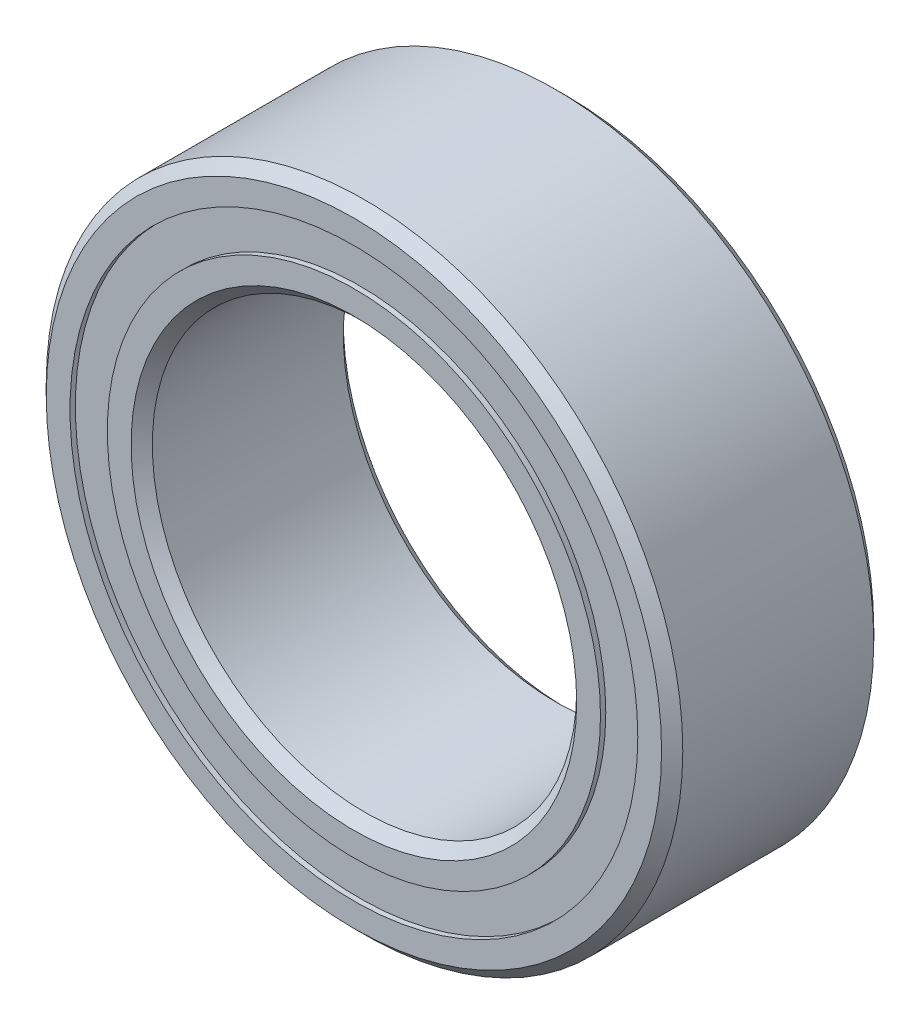
ISO-10303-21;
HEADER;
FILE_DESCRIPTION(('STEP AP214'),'2;1');
FILE_NAME('part.step','',(''),(''),'','','');
FILE_SCHEMA(('AUTOMOTIVE_DESIGN { 1 0 10303 214 1 1 1 1 }'));
ENDSEC;
DATA;
#1=APPLICATION_CONTEXT('core data for automotive mechanical design processes');
#2=APPLICATION_PROTOCOL_DEFINITION('international standard','automotive_design',2000,#1);
#3=PRODUCT_CONTEXT('',#1,'mechanical');
#4=PRODUCT('Part','Part','',(#3));
#5=PRODUCT_RELATED_PRODUCT_CATEGORY('part','',(#4));
#6=PRODUCT_DEFINITION_FORMATION('','',#4);
#7=PRODUCT_DEFINITION_CONTEXT('part definition',#1,'design');
#8=PRODUCT_DEFINITION('design','',#6,#7);
#9=PRODUCT_DEFINITION_SHAPE('','',#8);
#10=(LENGTH_UNIT() NAMED_UNIT(*) SI_UNIT(.MILLI.,.METRE.));
#11=(NAMED_UNIT(*) PLANE_ANGLE_UNIT() SI_UNIT($,.RADIAN.));
#12=(NAMED_UNIT(*) SI_UNIT($,.STERADIAN.) SOLID_ANGLE_UNIT());
#13=UNCERTAINTY_MEASURE_WITH_UNIT(LENGTH_MEASURE(1.E-05),#10,'distance_accuracy_value','');
#14=(GEOMETRIC_REPRESENTATION_CONTEXT(3) GLOBAL_UNCERTAINTY_ASSIGNED_CONTEXT((#13)) GLOBAL_UNIT_ASSIGNED_CONTEXT((#10,
#11,#12)) REPRESENTATION_CONTEXT('',''));
#15=CARTESIAN_POINT('',(0.,0.,0.));
#16=DIRECTION('',(0.,0.,1.));
#17=DIRECTION('',(1.,0.,0.));
#18=AXIS2_PLACEMENT_3D('',#15,#16,#17);
#19=CARTESIAN_POINT('',(0.,4.24787087912088,-1.508125));
#20=DIRECTION('',(0.,0.,1.));
#21=DIRECTION('',(1.,0.,0.));
#22=AXIS2_PLACEMENT_3D('',#19,#20,#21);
#23=PLANE('',#22);
#24=CARTESIAN_POINT('',(0.,0.,-1.508125));
#25=DIRECTION('',(0.,0.,1.));
#26=DIRECTION('',(1.,0.,0.));
#27=AXIS2_PLACEMENT_3D('',#24,#25,#26);
#28=CIRCLE('',#27,4.24787087912088);
#29=CARTESIAN_POINT('',(4.24787087912088,0.,-1.508125));
#30=VERTEX_POINT('',#29);
#31=EDGE_CURVE('E56',#30,#30,#28,.T.);
#32=ORIENTED_EDGE('',*,*,#31,.F.);
#33=EDGE_LOOP('',(#32));
#34=FACE_BOUND('',#33,.T.);
#35=CARTESIAN_POINT('',(0.,0.,-1.508125));
#36=DIRECTION('',(0.,0.,1.));
#37=DIRECTION('',(1.,0.,0.));
#38=AXIS2_PLACEMENT_3D('',#35,#36,#37);
#39=CIRCLE('',#38,3.68962912087912);
#40=CARTESIAN_POINT('',(3.68962912087912,0.,-1.508125));
#41=VERTEX_POINT('',#40);
#42=EDGE_CURVE('E11',#41,#41,#39,.T.);
#43=ORIENTED_EDGE('',*,*,#42,.T.);
#44=EDGE_LOOP('',(#43));
#45=FACE_BOUND('',#44,.T.);
#46=ADVANCED_FACE('F42',(#34,#45),#23,.F.);
#47=CARTESIAN_POINT('',(0.,0.,1.5875));
#48=DIRECTION('',(0.,0.,1.));
#49=DIRECTION('',(1.,0.,0.));
#50=AXIS2_PLACEMENT_3D('',#47,#48,#49);
#51=CYLINDRICAL_SURFACE('',#50,3.68962912087912);
#52=ORIENTED_EDGE('',*,*,#42,.F.);
#53=EDGE_LOOP('',(#52));
#54=FACE_BOUND('',#53,.T.);
#55=CARTESIAN_POINT('',(0.,0.,-0.758760243513405));
#56=DIRECTION('',(0.,0.,1.));
#57=DIRECTION('',(1.,0.,0.));
#58=AXIS2_PLACEMENT_3D('',#55,#56,#57);
#59=CIRCLE('',#58,3.68962912087912);
#60=CARTESIAN_POINT('',(3.68962912087912,0.,-0.758760243513405));
#61=VERTEX_POINT('',#60);
#62=EDGE_CURVE('E48',#61,#61,#59,.T.);
#63=ORIENTED_EDGE('',*,*,#62,.T.);
#64=EDGE_LOOP('',(#63));
#65=FACE_BOUND('',#64,.T.);
#66=ADVANCED_FACE('F65',(#54,#65),#51,.F.);
#67=CARTESIAN_POINT('',(0.,4.24787087912088,-0.758760243513405));
#68=DIRECTION('',(0.,0.,-1.));
#69=DIRECTION('',(-1.,0.,0.));
#70=AXIS2_PLACEMENT_3D('',#67,#68,#69);
#71=PLANE('',#70);
#72=ORIENTED_EDGE('',*,*,#62,.F.);
#73=EDGE_LOOP('',(#72));
#74=FACE_BOUND('',#73,.T.);
#75=CARTESIAN_POINT('',(0.,0.,-0.758760243513405));
#76=DIRECTION('',(0.,0.,1.));
#77=DIRECTION('',(1.,0.,0.));
#78=AXIS2_PLACEMENT_3D('',#75,#76,#77);
#79=CIRCLE('',#78,4.24787087912088);
#80=CARTESIAN_POINT('',(4.24787087912088,0.,-0.758760243513405));
#81=VERTEX_POINT('',#80);
#82=EDGE_CURVE('E52',#81,#81,#79,.T.);
#83=ORIENTED_EDGE('',*,*,#82,.T.);
#84=EDGE_LOOP('',(#83));
#85=FACE_BOUND('',#84,.T.);
#86=ADVANCED_FACE('F69',(#74,#85),#71,.F.);
#87=CARTESIAN_POINT('',(0.,0.,1.5875));
#88=DIRECTION('',(0.,0.,1.));
#89=DIRECTION('',(1.,0.,0.));
#90=AXIS2_PLACEMENT_3D('',#87,#88,#89);
#91=CYLINDRICAL_SURFACE('',#90,4.24787087912088);
#92=ORIENTED_EDGE('',*,*,#82,.F.);
#93=EDGE_LOOP('',(#92));
#94=FACE_BOUND('',#93,.T.);
#95=ORIENTED_EDGE('',*,*,#31,.T.);
#96=EDGE_LOOP('',(#95));
#97=FACE_BOUND('',#96,.T.);
#98=ADVANCED_FACE('F62',(#94,#97),#91,.T.);
#99=CLOSED_SHELL('',(#46,#66,#86,#98));
#100=MANIFOLD_SOLID_BREP('B2',#99);
#101=CARTESIAN_POINT('',(0.,4.24787087912088,1.508125));
#102=DIRECTION('',(0.,0.,-1.));
#103=DIRECTION('',(-1.,0.,0.));
#104=AXIS2_PLACEMENT_3D('',#101,#102,#103);
#105=PLANE('',#104);
#106=CARTESIAN_POINT('',(0.,0.,1.508125));
#107=DIRECTION('',(0.,0.,1.));
#108=DIRECTION('',(1.,0.,0.));
#109=AXIS2_PLACEMENT_3D('',#106,#107,#108);
#110=CIRCLE('',#109,3.68962912087912);
#111=CARTESIAN_POINT('',(3.68962912087912,0.,1.508125));
#112=VERTEX_POINT('',#111);
#113=EDGE_CURVE('E41',#112,#112,#110,.T.);
#114=ORIENTED_EDGE('',*,*,#113,.F.);
#115=EDGE_LOOP('',(#114));
#116=FACE_BOUND('',#115,.T.);
#117=CARTESIAN_POINT('',(0.,0.,1.508125));
#118=DIRECTION('',(0.,0.,1.));
#119=DIRECTION('',(1.,0.,0.));
#120=AXIS2_PLACEMENT_3D('',#117,#118,#119);
#121=CIRCLE('',#120,4.24787087912088);
#122=CARTESIAN_POINT('',(4.24787087912088,0.,1.508125));
#123=VERTEX_POINT('',#122);
#124=EDGE_CURVE('E124',#123,#123,#121,.T.);
#125=ORIENTED_EDGE('',*,*,#124,.T.);
#126=EDGE_LOOP('',(#125));
#127=FACE_BOUND('',#126,.T.);
#128=ADVANCED_FACE('F110',(#116,#127),#105,.F.);
#129=CARTESIAN_POINT('',(0.,0.,1.5875));
#130=DIRECTION('',(0.,0.,1.));
#131=DIRECTION('',(1.,0.,0.));
#132=AXIS2_PLACEMENT_3D('',#129,#130,#131);
#133=CYLINDRICAL_SURFACE('',#132,3.68962912087912);
#134=CARTESIAN_POINT('',(0.,0.,0.758760243513404));
#135=DIRECTION('',(0.,0.,1.));
#136=DIRECTION('',(1.,0.,0.));
#137=AXIS2_PLACEMENT_3D('',#134,#135,#136);
#138=CIRCLE('',#137,3.68962912087912);
#139=CARTESIAN_POINT('',(3.68962912087912,0.,0.758760243513404));
#140=VERTEX_POINT('',#139);
#141=EDGE_CURVE('E116',#140,#140,#138,.T.);
#142=ORIENTED_EDGE('',*,*,#141,.F.);
#143=EDGE_LOOP('',(#142));
#144=FACE_BOUND('',#143,.T.);
#145=ORIENTED_EDGE('',*,*,#113,.T.);
#146=EDGE_LOOP('',(#145));
#147=FACE_BOUND('',#146,.T.);
#148=ADVANCED_FACE('F139',(#144,#147),#133,.F.);
#149=CARTESIAN_POINT('',(0.,4.24787087912088,0.758760243513404));
#150=DIRECTION('',(0.,0.,1.));
#151=DIRECTION('',(1.,0.,0.));
#152=AXIS2_PLACEMENT_3D('',#149,#150,#151);
#153=PLANE('',#152);
#154=CARTESIAN_POINT('',(0.,0.,0.758760243513404));
#155=DIRECTION('',(0.,0.,1.));
#156=DIRECTION('',(1.,0.,0.));
#157=AXIS2_PLACEMENT_3D('',#154,#155,#156);
#158=CIRCLE('',#157,4.24787087912088);
#159=CARTESIAN_POINT('',(4.24787087912088,0.,0.758760243513404));
#160=VERTEX_POINT('',#159);
#161=EDGE_CURVE('E120',#160,#160,#158,.T.);
#162=ORIENTED_EDGE('',*,*,#161,.F.);
#163=EDGE_LOOP('',(#162));
#164=FACE_BOUND('',#163,.T.);
#165=ORIENTED_EDGE('',*,*,#141,.T.);
#166=EDGE_LOOP('',(#165));
#167=FACE_BOUND('',#166,.T.);
#168=ADVANCED_FACE('F134',(#164,#167),#153,.F.);
#169=CARTESIAN_POINT('',(0.,0.,1.5875));
#170=DIRECTION('',(0.,0.,1.));
#171=DIRECTION('',(1.,0.,0.));
#172=AXIS2_PLACEMENT_3D('',#169,#170,#171);
#173=CYLINDRICAL_SURFACE('',#172,4.24787087912088);
#174=ORIENTED_EDGE('',*,*,#124,.F.);
#175=EDGE_LOOP('',(#174));
#176=FACE_BOUND('',#175,.T.);
#177=ORIENTED_EDGE('',*,*,#161,.T.);
#178=EDGE_LOOP('',(#177));
#179=FACE_BOUND('',#178,.T.);
#180=ADVANCED_FACE('F131',(#176,#179),#173,.T.);
#181=CLOSED_SHELL('',(#128,#148,#168,#180));
#182=MANIFOLD_SOLID_BREP('B6',#181);
#183=CARTESIAN_POINT('',(-1.98437499999996,3.43703832126952,0.));
#184=DIRECTION('',(0.,0.,1.));
#185=DIRECTION('',(-0.499999999999989,0.866025403784445,0.));
#186=AXIS2_PLACEMENT_3D('',#183,#184,#185);
#187=SPHERICAL_SURFACE('',#186,0.758760243513404);
#188=CARTESIAN_POINT('',(-1.98437499999996,3.43703832126952,0.758760243513404));
#189=VERTEX_POINT('',#188);
#190=VERTEX_LOOP('',#189);
#191=FACE_BOUND('',#190,.T.);
#192=ADVANCED_FACE('F177',(#191),#187,.T.);
#193=CLOSED_SHELL('',(#192));
#194=MANIFOLD_SOLID_BREP('B36',#193);
#195=CARTESIAN_POINT('',(-3.43703832126947,1.98437500000004,0.));
#196=DIRECTION('',(0.,0.,1.));
#197=DIRECTION('',(-0.866025403784433,0.50000000000001,0.));
#198=AXIS2_PLACEMENT_3D('',#195,#196,#197);
#199=SPHERICAL_SURFACE('',#198,0.758760243513404);
#200=CARTESIAN_POINT('',(-3.43703832126947,1.98437500000004,0.758760243513404));
#201=VERTEX_POINT('',#200);
#202=VERTEX_LOOP('',#201);
#203=FACE_BOUND('',#202,.T.);
#204=ADVANCED_FACE('F197',(#203),#199,.T.);
#205=CLOSED_SHELL('',(#204));
#206=MANIFOLD_SOLID_BREP('B106',#205);
#207=CARTESIAN_POINT('',(-3.96875,0.,0.));
#208=DIRECTION('',(0.,0.,1.));
#209=DIRECTION('',(-1.,0.,0.));
#210=AXIS2_PLACEMENT_3D('',#207,#208,#209);
#211=SPHERICAL_SURFACE('',#210,0.758760243513404);
#212=CARTESIAN_POINT('',(-3.96875,0.,0.758760243513404));
#213=VERTEX_POINT('',#212);
#214=VERTEX_LOOP('',#213);
#215=FACE_BOUND('',#214,.T.);
#216=ADVANCED_FACE('F217',(#215),#211,.T.);
#217=CLOSED_SHELL('',(#216));
#218=MANIFOLD_SOLID_BREP('B173',#217);
#219=CARTESIAN_POINT('',(-3.43703832126951,-1.98437499999997,0.));
#220=DIRECTION('',(0.,0.,1.));
#221=DIRECTION('',(-0.866025403784443,-0.499999999999992,0.));
#222=AXIS2_PLACEMENT_3D('',#219,#220,#221);
#223=SPHERICAL_SURFACE('',#222,0.758760243513404);
#224=CARTESIAN_POINT('',(-3.43703832126951,-1.98437499999997,0.758760243513404));
#225=VERTEX_POINT('',#224);
#226=VERTEX_LOOP('',#225);
#227=FACE_BOUND('',#226,.T.);
#228=ADVANCED_FACE('F237',(#227),#223,.T.);
#229=CLOSED_SHELL('',(#228));
#230=MANIFOLD_SOLID_BREP('B193',#229);
#231=CARTESIAN_POINT('',(-1.98437500000003,-3.43703832126947,0.));
#232=DIRECTION('',(0.,0.,1.));
#233=DIRECTION('',(-0.500000000000007,-0.866025403784435,0.));
#234=AXIS2_PLACEMENT_3D('',#231,#232,#233);
#235=SPHERICAL_SURFACE('',#234,0.758760243513404);
#236=CARTESIAN_POINT('',(-1.98437500000003,-3.43703832126947,0.758760243513404));
#237=VERTEX_POINT('',#236);
#238=VERTEX_LOOP('',#237);
#239=FACE_BOUND('',#238,.T.);
#240=ADVANCED_FACE('F257',(#239),#235,.T.);
#241=CLOSED_SHELL('',(#240));
#242=MANIFOLD_SOLID_BREP('B213',#241);
#243=CARTESIAN_POINT('',(0.,-3.96875,0.));
#244=DIRECTION('',(0.,0.,1.));
#245=DIRECTION('',(0.,-1.,0.));
#246=AXIS2_PLACEMENT_3D('',#243,#244,#245);
#247=SPHERICAL_SURFACE('',#246,0.758760243513404);
#248=CARTESIAN_POINT('',(0.,-3.96875,0.758760243513404));
#249=VERTEX_POINT('',#248);
#250=VERTEX_LOOP('',#249);
#251=FACE_BOUND('',#250,.T.);
#252=ADVANCED_FACE('F277',(#251),#247,.T.);
#253=CLOSED_SHELL('',(#252));
#254=MANIFOLD_SOLID_BREP('B233',#253);
#255=CARTESIAN_POINT('',(1.98437499999998,-3.4370383212695,0.));
#256=DIRECTION('',(0.,0.,1.));
#257=DIRECTION('',(0.499999999999995,-0.866025403784442,0.));
#258=AXIS2_PLACEMENT_3D('',#255,#256,#257);
#259=SPHERICAL_SURFACE('',#258,0.758760243513404);
#260=CARTESIAN_POINT('',(1.98437499999998,-3.4370383212695,0.758760243513404));
#261=VERTEX_POINT('',#260);
#262=VERTEX_LOOP('',#261);
#263=FACE_BOUND('',#262,.T.);
#264=ADVANCED_FACE('F297',(#263),#259,.T.);
#265=CLOSED_SHELL('',(#264));
#266=MANIFOLD_SOLID_BREP('B253',#265);
#267=CARTESIAN_POINT('',(3.43703832126948,-1.98437500000002,0.));
#268=DIRECTION('',(0.,0.,1.));
#269=DIRECTION('',(0.866025403784436,-0.500000000000004,0.));
#270=AXIS2_PLACEMENT_3D('',#267,#268,#269);
#271=SPHERICAL_SURFACE('',#270,0.758760243513404);
#272=CARTESIAN_POINT('',(3.43703832126948,-1.98437500000002,0.758760243513404));
#273=VERTEX_POINT('',#272);
#274=VERTEX_LOOP('',#273);
#275=FACE_BOUND('',#274,.T.);
#276=ADVANCED_FACE('F317',(#275),#271,.T.);
#277=CLOSED_SHELL('',(#276));
#278=MANIFOLD_SOLID_BREP('B273',#277);
#279=CARTESIAN_POINT('',(3.96875,0.,0.));
#280=DIRECTION('',(0.,0.,1.));
#281=DIRECTION('',(1.,0.,0.));
#282=AXIS2_PLACEMENT_3D('',#279,#280,#281);
#283=SPHERICAL_SURFACE('',#282,0.758760243513404);
#284=CARTESIAN_POINT('',(3.96875,0.,0.758760243513404));
#285=VERTEX_POINT('',#284);
#286=VERTEX_LOOP('',#285);
#287=FACE_BOUND('',#286,.T.);
#288=ADVANCED_FACE('F337',(#287),#283,.T.);
#289=CLOSED_SHELL('',(#288));
#290=MANIFOLD_SOLID_BREP('B293',#289);
#291=CARTESIAN_POINT('',(3.4370383212695,1.98437499999999,0.));
#292=DIRECTION('',(0.,0.,1.));
#293=DIRECTION('',(0.86602540378444,0.499999999999998,0.));
#294=AXIS2_PLACEMENT_3D('',#291,#292,#293);
#295=SPHERICAL_SURFACE('',#294,0.758760243513404);
#296=CARTESIAN_POINT('',(3.4370383212695,1.98437499999999,0.758760243513404));
#297=VERTEX_POINT('',#296);
#298=VERTEX_LOOP('',#297);
#299=FACE_BOUND('',#298,.T.);
#300=ADVANCED_FACE('F357',(#299),#295,.T.);
#301=CLOSED_SHELL('',(#300));
#302=MANIFOLD_SOLID_BREP('B313',#301);
#303=CARTESIAN_POINT('',(1.984375,3.43703832126949,0.));
#304=DIRECTION('',(0.,0.,1.));
#305=DIRECTION('',(0.500000000000001,0.866025403784438,0.));
#306=AXIS2_PLACEMENT_3D('',#303,#304,#305);
#307=SPHERICAL_SURFACE('',#306,0.758760243513404);
#308=CARTESIAN_POINT('',(1.984375,3.43703832126949,0.758760243513404));
#309=VERTEX_POINT('',#308);
#310=VERTEX_LOOP('',#309);
#311=FACE_BOUND('',#310,.T.);
#312=ADVANCED_FACE('F377',(#311),#307,.T.);
#313=CLOSED_SHELL('',(#312));
#314=MANIFOLD_SOLID_BREP('B333',#313);
#315=CARTESIAN_POINT('',(0.,3.96875,0.));
#316=DIRECTION('',(0.,0.,1.));
#317=DIRECTION('',(0.,1.,0.));
#318=AXIS2_PLACEMENT_3D('',#315,#316,#317);
#319=SPHERICAL_SURFACE('',#318,0.758760243513404);
#320=CARTESIAN_POINT('',(0.,3.96875,0.758760243513404));
#321=VERTEX_POINT('',#320);
#322=VERTEX_LOOP('',#321);
#323=FACE_BOUND('',#322,.T.);
#324=ADVANCED_FACE('F400',(#323),#319,.T.);
#325=CLOSED_SHELL('',(#324));
#326=MANIFOLD_SOLID_BREP('B353',#325);
#327=CARTESIAN_POINT('',(0.,3.68962912087912,1.5875));
#328=DIRECTION('',(0.,0.,-1.));
#329=DIRECTION('',(-1.,0.,0.));
#330=AXIS2_PLACEMENT_3D('',#327,#328,#329);
#331=PLANE('',#330);
#332=CARTESIAN_POINT('',(0.,0.,1.5875));
#333=DIRECTION('',(0.,0.,1.));
#334=DIRECTION('',(1.,0.,0.));
#335=AXIS2_PLACEMENT_3D('',#332,#333,#334);
#336=CIRCLE('',#335,3.33375);
#337=CARTESIAN_POINT('',(3.33375,0.,1.5875));
#338=VERTEX_POINT('',#337);
#339=EDGE_CURVE('E448',#338,#338,#336,.T.);
#340=ORIENTED_EDGE('',*,*,#339,.F.);
#341=EDGE_LOOP('',(#340));
#342=FACE_BOUND('',#341,.T.);
#343=CARTESIAN_POINT('',(0.,0.,1.5875));
#344=DIRECTION('',(0.,0.,1.));
#345=DIRECTION('',(1.,0.,0.));
#346=AXIS2_PLACEMENT_3D('',#343,#344,#345);
#347=CIRCLE('',#346,3.68962912087912);
#348=CARTESIAN_POINT('',(3.68962912087912,0.,1.5875));
#349=VERTEX_POINT('',#348);
#350=EDGE_CURVE('E399',#349,#349,#347,.T.);
#351=ORIENTED_EDGE('',*,*,#350,.T.);
#352=EDGE_LOOP('',(#351));
#353=FACE_BOUND('',#352,.T.);
#354=ADVANCED_FACE('F420',(#342,#353),#331,.F.);
#355=CARTESIAN_POINT('',(0.,0.,1.5875));
#356=DIRECTION('',(0.,0.,1.));
#357=DIRECTION('',(1.,0.,0.));
#358=AXIS2_PLACEMENT_3D('',#355,#356,#357);
#359=CYLINDRICAL_SURFACE('',#358,3.68962912087912);
#360=ORIENTED_EDGE('',*,*,#350,.F.);
#361=EDGE_LOOP('',(#360));
#362=FACE_BOUND('',#361,.T.);
#363=CARTESIAN_POINT('',(0.,0.,0.705555555555556));
#364=DIRECTION('',(0.,0.,1.));
#365=DIRECTION('',(1.,0.,0.));
#366=AXIS2_PLACEMENT_3D('',#363,#364,#365);
#367=CIRCLE('',#366,3.68962912087912);
#368=CARTESIAN_POINT('',(3.68962912087912,0.,0.705555555555556));
#369=VERTEX_POINT('',#368);
#370=EDGE_CURVE('E426',#369,#369,#367,.T.);
#371=ORIENTED_EDGE('',*,*,#370,.T.);
#372=EDGE_LOOP('',(#371));
#373=FACE_BOUND('',#372,.T.);
#374=ADVANCED_FACE('F455',(#362,#373),#359,.T.);
#375=CARTESIAN_POINT('',(0.,0.,0.));
#376=DIRECTION('',(0.,0.,1.));
#377=DIRECTION('',(1.,0.,0.));
#378=AXIS2_PLACEMENT_3D('',#375,#376,#377);
#379=TOROIDAL_SURFACE('',#378,3.96875,0.758760243513403);
#380=ORIENTED_EDGE('',*,*,#370,.F.);
#381=EDGE_LOOP('',(#380));
#382=FACE_BOUND('',#381,.T.);
#383=CARTESIAN_POINT('',(0.,0.,-0.705555555555557));
#384=DIRECTION('',(0.,0.,1.));
#385=DIRECTION('',(1.,0.,0.));
#386=AXIS2_PLACEMENT_3D('',#383,#384,#385);
#387=CIRCLE('',#386,3.68962912087912);
#388=CARTESIAN_POINT('',(3.68962912087912,0.,-0.705555555555557));
#389=VERTEX_POINT('',#388);
#390=EDGE_CURVE('E430',#389,#389,#387,.T.);
#391=ORIENTED_EDGE('',*,*,#390,.T.);
#392=EDGE_LOOP('',(#391));
#393=FACE_BOUND('',#392,.T.);
#394=ADVANCED_FACE('F459',(#382,#393),#379,.F.);
#395=CARTESIAN_POINT('',(0.,0.,1.5875));
#396=DIRECTION('',(0.,0.,1.));
#397=DIRECTION('',(1.,0.,0.));
#398=AXIS2_PLACEMENT_3D('',#395,#396,#397);
#399=CYLINDRICAL_SURFACE('',#398,3.68962912087912);
#400=ORIENTED_EDGE('',*,*,#390,.F.);
#401=EDGE_LOOP('',(#400));
#402=FACE_BOUND('',#401,.T.);
#403=CARTESIAN_POINT('',(0.,0.,-1.5875));
#404=DIRECTION('',(0.,0.,1.));
#405=DIRECTION('',(1.,0.,0.));
#406=AXIS2_PLACEMENT_3D('',#403,#404,#405);
#407=CIRCLE('',#406,3.68962912087912);
#408=CARTESIAN_POINT('',(3.68962912087912,0.,-1.5875));
#409=VERTEX_POINT('',#408);
#410=EDGE_CURVE('E434',#409,#409,#407,.T.);
#411=ORIENTED_EDGE('',*,*,#410,.T.);
#412=EDGE_LOOP('',(#411));
#413=FACE_BOUND('',#412,.T.);
#414=ADVANCED_FACE('F464',(#402,#413),#399,.T.);
#415=CARTESIAN_POINT('',(0.,3.33375,-1.5875));
#416=DIRECTION('',(0.,0.,1.));
#417=DIRECTION('',(1.,0.,0.));
#418=AXIS2_PLACEMENT_3D('',#415,#416,#417);
#419=PLANE('',#418);
#420=ORIENTED_EDGE('',*,*,#410,.F.);
#421=EDGE_LOOP('',(#420));
#422=FACE_BOUND('',#421,.T.);
#423=CARTESIAN_POINT('',(0.,0.,-1.5875));
#424=DIRECTION('',(0.,0.,1.));
#425=DIRECTION('',(1.,0.,0.));
#426=AXIS2_PLACEMENT_3D('',#423,#424,#425);
#427=CIRCLE('',#426,3.33375);
#428=CARTESIAN_POINT('',(3.33375,0.,-1.5875));
#429=VERTEX_POINT('',#428);
#430=EDGE_CURVE('E439',#429,#429,#427,.T.);
#431=ORIENTED_EDGE('',*,*,#430,.T.);
#432=EDGE_LOOP('',(#431));
#433=FACE_BOUND('',#432,.T.);
#434=ADVANCED_FACE('F470',(#422,#433),#419,.F.);
#435=CARTESIAN_POINT('',(0.,0.,-1.42875));
#436=DIRECTION('',(0.,0.,-1.));
#437=DIRECTION('',(-1.,0.,0.));
#438=AXIS2_PLACEMENT_3D('',#435,#436,#437);
#439=CONICAL_SURFACE('',#438,3.175,0.785398163397451);
#440=ORIENTED_EDGE('',*,*,#430,.F.);
#441=EDGE_LOOP('',(#440));
#442=FACE_BOUND('',#441,.T.);
#443=CARTESIAN_POINT('',(0.,0.,-1.42875));
#444=DIRECTION('',(0.,0.,1.));
#445=DIRECTION('',(1.,0.,0.));
#446=AXIS2_PLACEMENT_3D('',#443,#444,#445);
#447=CIRCLE('',#446,3.175);
#448=CARTESIAN_POINT('',(3.175,0.,-1.42875));
#449=VERTEX_POINT('',#448);
#450=EDGE_CURVE('E442',#449,#449,#447,.T.);
#451=ORIENTED_EDGE('',*,*,#450,.T.);
#452=EDGE_LOOP('',(#451));
#453=FACE_BOUND('',#452,.T.);
#454=ADVANCED_FACE('F474',(#442,#453),#439,.F.);
#455=CARTESIAN_POINT('',(0.,0.,1.5875));
#456=DIRECTION('',(0.,0.,1.));
#457=DIRECTION('',(1.,0.,0.));
#458=AXIS2_PLACEMENT_3D('',#455,#456,#457);
#459=CYLINDRICAL_SURFACE('',#458,3.175);
#460=ORIENTED_EDGE('',*,*,#450,.F.);
#461=EDGE_LOOP('',(#460));
#462=FACE_BOUND('',#461,.T.);
#463=CARTESIAN_POINT('',(0.,0.,1.42875));
#464=DIRECTION('',(0.,0.,1.));
#465=DIRECTION('',(1.,0.,0.));
#466=AXIS2_PLACEMENT_3D('',#463,#464,#465);
#467=CIRCLE('',#466,3.175);
#468=CARTESIAN_POINT('',(3.175,0.,1.42875));
#469=VERTEX_POINT('',#468);
#470=EDGE_CURVE('E445',#469,#469,#467,.T.);
#471=ORIENTED_EDGE('',*,*,#470,.T.);
#472=EDGE_LOOP('',(#471));
#473=FACE_BOUND('',#472,.T.);
#474=ADVANCED_FACE('F478',(#462,#473),#459,.F.);
#475=CARTESIAN_POINT('',(0.,0.,1.5875));
#476=DIRECTION('',(0.,0.,1.));
#477=DIRECTION('',(1.,0.,0.));
#478=AXIS2_PLACEMENT_3D('',#475,#476,#477);
#479=CONICAL_SURFACE('',#478,3.33375,0.785398163397448);
#480=ORIENTED_EDGE('',*,*,#470,.F.);
#481=EDGE_LOOP('',(#480));
#482=FACE_BOUND('',#481,.T.);
#483=ORIENTED_EDGE('',*,*,#339,.T.);
#484=EDGE_LOOP('',(#483));
#485=FACE_BOUND('',#484,.T.);
#486=ADVANCED_FACE('F452',(#482,#485),#479,.F.);
#487=CLOSED_SHELL('',(#354,#374,#394,#414,#434,#454,#474,#486));
#488=MANIFOLD_SOLID_BREP('B373',#487);
#489=CARTESIAN_POINT('',(0.,0.,1.42875));
#490=DIRECTION('',(0.,0.,-1.));
#491=DIRECTION('',(-1.,0.,0.));
#492=AXIS2_PLACEMENT_3D('',#489,#490,#491);
#493=CONICAL_SURFACE('',#492,4.7625,0.785398163397446);
#494=CARTESIAN_POINT('',(0.,0.,1.5875));
#495=DIRECTION('',(0.,0.,1.));
#496=DIRECTION('',(1.,0.,0.));
#497=AXIS2_PLACEMENT_3D('',#494,#495,#496);
#498=CIRCLE('',#497,4.60375);
#499=CARTESIAN_POINT('',(4.60375,0.,1.5875));
#500=VERTEX_POINT('',#499);
#501=EDGE_CURVE('E570',#500,#500,#498,.T.);
#502=ORIENTED_EDGE('',*,*,#501,.F.);
#503=EDGE_LOOP('',(#502));
#504=FACE_BOUND('',#503,.T.);
#505=CARTESIAN_POINT('',(0.,0.,1.42875));
#506=DIRECTION('',(0.,0.,1.));
#507=DIRECTION('',(1.,0.,0.));
#508=AXIS2_PLACEMENT_3D('',#505,#506,#507);
#509=CIRCLE('',#508,4.7625);
#510=CARTESIAN_POINT('',(4.7625,0.,1.42875));
#511=VERTEX_POINT('',#510);
#512=EDGE_CURVE('E419',#511,#511,#509,.T.);
#513=ORIENTED_EDGE('',*,*,#512,.T.);
#514=EDGE_LOOP('',(#513));
#515=FACE_BOUND('',#514,.T.);
#516=ADVANCED_FACE('F542',(#504,#515),#493,.T.);
#517=CARTESIAN_POINT('',(0.,0.,1.5875));
#518=DIRECTION('',(0.,0.,1.));
#519=DIRECTION('',(1.,0.,0.));
#520=AXIS2_PLACEMENT_3D('',#517,#518,#519);
#521=CYLINDRICAL_SURFACE('',#520,4.7625);
#522=ORIENTED_EDGE('',*,*,#512,.F.);
#523=EDGE_LOOP('',(#522));
#524=FACE_BOUND('',#523,.T.);
#525=CARTESIAN_POINT('',(0.,0.,-1.42875));
#526=DIRECTION('',(0.,0.,1.));
#527=DIRECTION('',(1.,0.,0.));
#528=AXIS2_PLACEMENT_3D('',#525,#526,#527);
#529=CIRCLE('',#528,4.7625);
#530=CARTESIAN_POINT('',(4.7625,0.,-1.42875));
#531=VERTEX_POINT('',#530);
#532=EDGE_CURVE('E548',#531,#531,#529,.T.);
#533=ORIENTED_EDGE('',*,*,#532,.T.);
#534=EDGE_LOOP('',(#533));
#535=FACE_BOUND('',#534,.T.);
#536=ADVANCED_FACE('F577',(#524,#535),#521,.T.);
#537=CARTESIAN_POINT('',(0.,0.,-1.5875));
#538=DIRECTION('',(0.,0.,1.));
#539=DIRECTION('',(1.,0.,0.));
#540=AXIS2_PLACEMENT_3D('',#537,#538,#539);
#541=CONICAL_SURFACE('',#540,4.60375,0.785398163397446);
#542=ORIENTED_EDGE('',*,*,#532,.F.);
#543=EDGE_LOOP('',(#542));
#544=FACE_BOUND('',#543,.T.);
#545=CARTESIAN_POINT('',(0.,0.,-1.5875));
#546=DIRECTION('',(0.,0.,1.));
#547=DIRECTION('',(1.,0.,0.));
#548=AXIS2_PLACEMENT_3D('',#545,#546,#547);
#549=CIRCLE('',#548,4.60375);
#550=CARTESIAN_POINT('',(4.60375,0.,-1.5875));
#551=VERTEX_POINT('',#550);
#552=EDGE_CURVE('E552',#551,#551,#549,.T.);
#553=ORIENTED_EDGE('',*,*,#552,.T.);
#554=EDGE_LOOP('',(#553));
#555=FACE_BOUND('',#554,.T.);
#556=ADVANCED_FACE('F581',(#544,#555),#541,.T.);
#557=CARTESIAN_POINT('',(0.,4.60375,-1.5875));
#558=DIRECTION('',(0.,0.,1.));
#559=DIRECTION('',(1.,0.,0.));
#560=AXIS2_PLACEMENT_3D('',#557,#558,#559);
#561=PLANE('',#560);
#562=ORIENTED_EDGE('',*,*,#552,.F.);
#563=EDGE_LOOP('',(#562));
#564=FACE_BOUND('',#563,.T.);
#565=CARTESIAN_POINT('',(0.,0.,-1.5875));
#566=DIRECTION('',(0.,0.,1.));
#567=DIRECTION('',(1.,0.,0.));
#568=AXIS2_PLACEMENT_3D('',#565,#566,#567);
#569=CIRCLE('',#568,4.24787087912088);
#570=CARTESIAN_POINT('',(4.24787087912088,0.,-1.5875));
#571=VERTEX_POINT('',#570);
#572=EDGE_CURVE('E556',#571,#571,#569,.T.);
#573=ORIENTED_EDGE('',*,*,#572,.T.);
#574=EDGE_LOOP('',(#573));
#575=FACE_BOUND('',#574,.T.);
#576=ADVANCED_FACE('F586',(#564,#575),#561,.F.);
#577=CARTESIAN_POINT('',(0.,0.,1.5875));
#578=DIRECTION('',(0.,0.,1.));
#579=DIRECTION('',(1.,0.,0.));
#580=AXIS2_PLACEMENT_3D('',#577,#578,#579);
#581=CYLINDRICAL_SURFACE('',#580,4.24787087912088);
#582=ORIENTED_EDGE('',*,*,#572,.F.);
#583=EDGE_LOOP('',(#582));
#584=FACE_BOUND('',#583,.T.);
#585=CARTESIAN_POINT('',(0.,0.,-0.705555555555556));
#586=DIRECTION('',(0.,0.,1.));
#587=DIRECTION('',(1.,0.,0.));
#588=AXIS2_PLACEMENT_3D('',#585,#586,#587);
#589=CIRCLE('',#588,4.24787087912088);
#590=CARTESIAN_POINT('',(4.24787087912088,0.,-0.705555555555556));
#591=VERTEX_POINT('',#590);
#592=EDGE_CURVE('E561',#591,#591,#589,.T.);
#593=ORIENTED_EDGE('',*,*,#592,.T.);
#594=EDGE_LOOP('',(#593));
#595=FACE_BOUND('',#594,.T.);
#596=ADVANCED_FACE('F592',(#584,#595),#581,.F.);
#597=CARTESIAN_POINT('',(0.,0.,0.));
#598=DIRECTION('',(0.,0.,1.));
#599=DIRECTION('',(1.,0.,0.));
#600=AXIS2_PLACEMENT_3D('',#597,#598,#599);
#601=TOROIDAL_SURFACE('',#600,3.96875,0.758760243513404);
#602=ORIENTED_EDGE('',*,*,#592,.F.);
#603=EDGE_LOOP('',(#602));
#604=FACE_BOUND('',#603,.T.);
#605=CARTESIAN_POINT('',(0.,0.,0.705555555555555));
#606=DIRECTION('',(0.,0.,1.));
#607=DIRECTION('',(1.,0.,0.));
#608=AXIS2_PLACEMENT_3D('',#605,#606,#607);
#609=CIRCLE('',#608,4.24787087912088);
#610=CARTESIAN_POINT('',(4.24787087912088,0.,0.705555555555555));
#611=VERTEX_POINT('',#610);
#612=EDGE_CURVE('E564',#611,#611,#609,.T.);
#613=ORIENTED_EDGE('',*,*,#612,.T.);
#614=EDGE_LOOP('',(#613));
#615=FACE_BOUND('',#614,.T.);
#616=ADVANCED_FACE('F596',(#604,#615),#601,.F.);
#617=CARTESIAN_POINT('',(0.,0.,1.5875));
#618=DIRECTION('',(0.,0.,1.));
#619=DIRECTION('',(1.,0.,0.));
#620=AXIS2_PLACEMENT_3D('',#617,#618,#619);
#621=CYLINDRICAL_SURFACE('',#620,4.24787087912088);
#622=ORIENTED_EDGE('',*,*,#612,.F.);
#623=EDGE_LOOP('',(#622));
#624=FACE_BOUND('',#623,.T.);
#625=CARTESIAN_POINT('',(0.,0.,1.5875));
#626=DIRECTION('',(0.,0.,1.));
#627=DIRECTION('',(1.,0.,0.));
#628=AXIS2_PLACEMENT_3D('',#625,#626,#627);
#629=CIRCLE('',#628,4.24787087912088);
#630=CARTESIAN_POINT('',(4.24787087912088,0.,1.5875));
#631=VERTEX_POINT('',#630);
#632=EDGE_CURVE('E567',#631,#631,#629,.T.);
#633=ORIENTED_EDGE('',*,*,#632,.T.);
#634=EDGE_LOOP('',(#633));
#635=FACE_BOUND('',#634,.T.);
#636=ADVANCED_FACE('F600',(#624,#635),#621,.F.);
#637=CARTESIAN_POINT('',(0.,4.60375,1.5875));
#638=DIRECTION('',(0.,0.,-1.));
#639=DIRECTION('',(-1.,0.,0.));
#640=AXIS2_PLACEMENT_3D('',#637,#638,#639);
#641=PLANE('',#640);
#642=ORIENTED_EDGE('',*,*,#632,.F.);
#643=EDGE_LOOP('',(#642));
#644=FACE_BOUND('',#643,.T.);
#645=ORIENTED_EDGE('',*,*,#501,.T.);
#646=EDGE_LOOP('',(#645));
#647=FACE_BOUND('',#646,.T.);
#648=ADVANCED_FACE('F574',(#644,#647),#641,.F.);
#649=CLOSED_SHELL('',(#516,#536,#556,#576,#596,#616,#636,#648));
#650=MANIFOLD_SOLID_BREP('B394',#649);
#651=ADVANCED_BREP_SHAPE_REPRESENTATION('',(#18,#100,#182,#194,#206,#218,#230,#242,#254,#266,
#278,#290,#302,#314,#326,#488,#650),#14);
#652=SHAPE_DEFINITION_REPRESENTATION(#9,#651);
ENDSEC;
END-ISO-10303-21;
